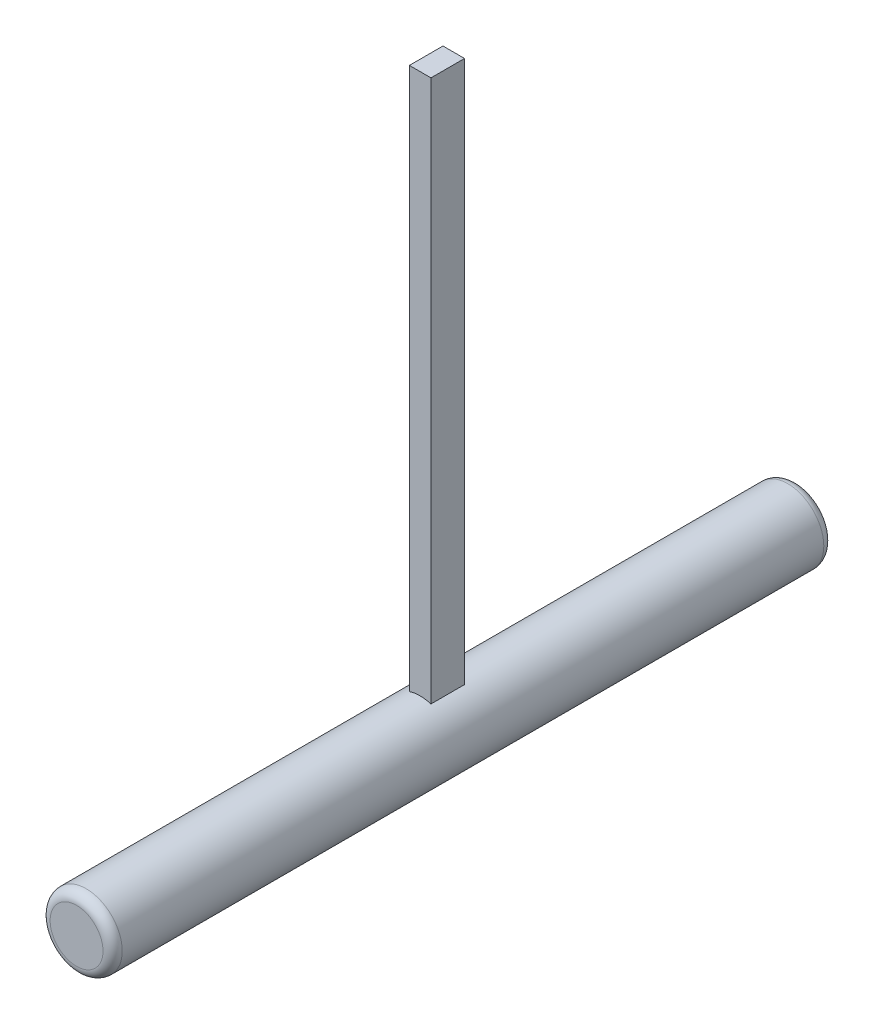
ISO-10303-21;
HEADER;
FILE_DESCRIPTION(('STEP AP214'),'2;1');
FILE_NAME('part.step','',(''),(''),'','','');
FILE_SCHEMA(('AUTOMOTIVE_DESIGN { 1 0 10303 214 1 1 1 1 }'));
ENDSEC;
DATA;
#1=APPLICATION_CONTEXT('core data for automotive mechanical design processes');
#2=APPLICATION_PROTOCOL_DEFINITION('international standard','automotive_design',2000,#1);
#3=PRODUCT_CONTEXT('',#1,'mechanical');
#4=PRODUCT('Part','Part','',(#3));
#5=PRODUCT_RELATED_PRODUCT_CATEGORY('part','',(#4));
#6=PRODUCT_DEFINITION_FORMATION('','',#4);
#7=PRODUCT_DEFINITION_CONTEXT('part definition',#1,'design');
#8=PRODUCT_DEFINITION('design','',#6,#7);
#9=PRODUCT_DEFINITION_SHAPE('','',#8);
#10=(LENGTH_UNIT() NAMED_UNIT(*) SI_UNIT(.MILLI.,.METRE.));
#11=(NAMED_UNIT(*) PLANE_ANGLE_UNIT() SI_UNIT($,.RADIAN.));
#12=(NAMED_UNIT(*) SI_UNIT($,.STERADIAN.) SOLID_ANGLE_UNIT());
#13=UNCERTAINTY_MEASURE_WITH_UNIT(LENGTH_MEASURE(1.E-05),#10,'distance_accuracy_value','');
#14=(GEOMETRIC_REPRESENTATION_CONTEXT(3) GLOBAL_UNCERTAINTY_ASSIGNED_CONTEXT((#13)) GLOBAL_UNIT_ASSIGNED_CONTEXT((#10,
#11,#12)) REPRESENTATION_CONTEXT('',''));
#15=CARTESIAN_POINT('',(0.,0.,0.));
#16=DIRECTION('',(0.,0.,1.));
#17=DIRECTION('',(1.,0.,0.));
#18=AXIS2_PLACEMENT_3D('',#15,#16,#17);
#19=CARTESIAN_POINT('',(0.,0.,150.));
#20=DIRECTION('',(0.,0.,-1.));
#21=DIRECTION('',(-1.,0.,0.));
#22=AXIS2_PLACEMENT_3D('',#19,#20,#21);
#23=CYLINDRICAL_SURFACE('',#22,7.5);
#24=DIRECTION('',(0.,0.,-1.));
#25=VECTOR('',#24,1.);
#26=CARTESIAN_POINT('',(-2.24499999999998,7.1561145183682,150.));
#27=LINE('',#26,#25);
#28=CARTESIAN_POINT('',(-2.24499999999999,7.15611451836819,71.505));
#29=VERTEX_POINT('',#28);
#30=CARTESIAN_POINT('',(-2.24499999999998,7.1561145183682,78.495));
#31=VERTEX_POINT('',#30);
#32=EDGE_CURVE('E123',#29,#31,#27,.F.);
#33=ORIENTED_EDGE('',*,*,#32,.F.);
#34=CARTESIAN_POINT('',(0.,0.,71.505));
#35=DIRECTION('',(0.,0.,-1.));
#36=DIRECTION('',(-1.,0.,0.));
#37=AXIS2_PLACEMENT_3D('',#34,#35,#36);
#38=CIRCLE('',#37,7.5);
#39=CARTESIAN_POINT('',(2.24500000000001,7.15611451836819,71.505));
#40=VERTEX_POINT('',#39);
#41=EDGE_CURVE('E115',#40,#29,#38,.F.);
#42=ORIENTED_EDGE('',*,*,#41,.F.);
#43=DIRECTION('',(0.,0.,-1.));
#44=VECTOR('',#43,1.);
#45=CARTESIAN_POINT('',(2.24500000000001,7.15611451836819,150.));
#46=LINE('',#45,#44);
#47=CARTESIAN_POINT('',(2.24500000000001,7.15611451836819,78.495));
#48=VERTEX_POINT('',#47);
#49=EDGE_CURVE('E62',#48,#40,#46,.T.);
#50=ORIENTED_EDGE('',*,*,#49,.F.);
#51=CARTESIAN_POINT('',(0.,0.,78.495));
#52=DIRECTION('',(0.,0.,1.));
#53=DIRECTION('',(1.,0.,0.));
#54=AXIS2_PLACEMENT_3D('',#51,#52,#53);
#55=CIRCLE('',#54,7.5);
#56=EDGE_CURVE('E55',#31,#48,#55,.F.);
#57=ORIENTED_EDGE('',*,*,#56,.F.);
#58=EDGE_LOOP('',(#33,#42,#50,#57));
#59=FACE_BOUND('',#58,.T.);
#60=CARTESIAN_POINT('',(0.,0.,2.));
#61=DIRECTION('',(0.,0.,1.));
#62=DIRECTION('',(1.,0.,0.));
#63=AXIS2_PLACEMENT_3D('',#60,#61,#62);
#64=CIRCLE('',#63,7.5);
#65=CARTESIAN_POINT('',(7.5,0.,2.));
#66=VERTEX_POINT('',#65);
#67=EDGE_CURVE('E128',#66,#66,#64,.T.);
#68=ORIENTED_EDGE('',*,*,#67,.T.);
#69=EDGE_LOOP('',(#68));
#70=FACE_BOUND('',#69,.T.);
#71=CARTESIAN_POINT('',(0.,0.,148.));
#72=DIRECTION('',(0.,0.,1.));
#73=DIRECTION('',(1.,0.,0.));
#74=AXIS2_PLACEMENT_3D('',#71,#72,#73);
#75=CIRCLE('',#74,7.5);
#76=CARTESIAN_POINT('',(7.5,0.,148.));
#77=VERTEX_POINT('',#76);
#78=EDGE_CURVE('E124',#77,#77,#75,.F.);
#79=ORIENTED_EDGE('',*,*,#78,.T.);
#80=EDGE_LOOP('',(#79));
#81=FACE_BOUND('',#80,.T.);
#82=ADVANCED_FACE('F39',(#59,#70,#81),#23,.T.);
#83=CARTESIAN_POINT('',(0.,0.,150.));
#84=DIRECTION('',(0.,0.,1.));
#85=DIRECTION('',(1.,0.,0.));
#86=AXIS2_PLACEMENT_3D('',#83,#84,#85);
#87=PLANE('',#86);
#88=CARTESIAN_POINT('',(0.,0.,150.));
#89=DIRECTION('',(0.,0.,1.));
#90=DIRECTION('',(1.,0.,0.));
#91=AXIS2_PLACEMENT_3D('',#88,#89,#90);
#92=CIRCLE('',#91,5.5);
#93=CARTESIAN_POINT('',(5.5,0.,150.));
#94=VERTEX_POINT('',#93);
#95=EDGE_CURVE('E11',#94,#94,#92,.T.);
#96=ORIENTED_EDGE('',*,*,#95,.T.);
#97=EDGE_LOOP('',(#96));
#98=FACE_BOUND('',#97,.T.);
#99=ADVANCED_FACE('F144',(#98),#87,.T.);
#100=CARTESIAN_POINT('',(0.,0.,0.));
#101=DIRECTION('',(0.,0.,1.));
#102=DIRECTION('',(1.,0.,0.));
#103=AXIS2_PLACEMENT_3D('',#100,#101,#102);
#104=PLANE('',#103);
#105=CARTESIAN_POINT('',(0.,0.,0.));
#106=DIRECTION('',(0.,0.,1.));
#107=DIRECTION('',(1.,0.,0.));
#108=AXIS2_PLACEMENT_3D('',#105,#106,#107);
#109=CIRCLE('',#108,5.5);
#110=CARTESIAN_POINT('',(5.5,0.,0.));
#111=VERTEX_POINT('',#110);
#112=EDGE_CURVE('E48',#111,#111,#109,.F.);
#113=ORIENTED_EDGE('',*,*,#112,.T.);
#114=EDGE_LOOP('',(#113));
#115=FACE_BOUND('',#114,.T.);
#116=ADVANCED_FACE('F135',(#115),#104,.F.);
#117=CARTESIAN_POINT('',(0.,0.,2.));
#118=DIRECTION('',(0.,0.,1.));
#119=DIRECTION('',(1.,0.,0.));
#120=AXIS2_PLACEMENT_3D('',#117,#118,#119);
#121=TOROIDAL_SURFACE('',#120,5.5,2.);
#122=ORIENTED_EDGE('',*,*,#112,.F.);
#123=EDGE_LOOP('',(#122));
#124=FACE_BOUND('',#123,.T.);
#125=ORIENTED_EDGE('',*,*,#67,.F.);
#126=EDGE_LOOP('',(#125));
#127=FACE_BOUND('',#126,.T.);
#128=ADVANCED_FACE('F137',(#124,#127),#121,.T.);
#129=CARTESIAN_POINT('',(0.,0.,148.));
#130=DIRECTION('',(0.,0.,1.));
#131=DIRECTION('',(1.,0.,0.));
#132=AXIS2_PLACEMENT_3D('',#129,#130,#131);
#133=TOROIDAL_SURFACE('',#132,5.5,2.);
#134=ORIENTED_EDGE('',*,*,#78,.F.);
#135=EDGE_LOOP('',(#134));
#136=FACE_BOUND('',#135,.T.);
#137=ORIENTED_EDGE('',*,*,#95,.F.);
#138=EDGE_LOOP('',(#137));
#139=FACE_BOUND('',#138,.T.);
#140=ADVANCED_FACE('F41',(#136,#139),#133,.T.);
#141=CARTESIAN_POINT('',(0.,120.,0.));
#142=DIRECTION('',(0.,1.,0.));
#143=DIRECTION('',(0.,0.,1.));
#144=AXIS2_PLACEMENT_3D('',#141,#142,#143);
#145=PLANE('',#144);
#146=DIRECTION('',(0.,0.,-1.));
#147=VECTOR('',#146,1.);
#148=CARTESIAN_POINT('',(2.24500000000001,120.,71.505));
#149=LINE('',#148,#147);
#150=CARTESIAN_POINT('',(2.24500000000001,120.,78.495));
#151=VERTEX_POINT('',#150);
#152=CARTESIAN_POINT('',(2.24500000000001,120.,71.505));
#153=VERTEX_POINT('',#152);
#154=EDGE_CURVE('E83',#151,#153,#149,.T.);
#155=ORIENTED_EDGE('',*,*,#154,.T.);
#156=DIRECTION('',(-1.,0.,0.));
#157=VECTOR('',#156,1.);
#158=CARTESIAN_POINT('',(-2.24499999999999,120.,71.505));
#159=LINE('',#158,#157);
#160=CARTESIAN_POINT('',(-2.24499999999999,120.,71.505));
#161=VERTEX_POINT('',#160);
#162=EDGE_CURVE('E93',#153,#161,#159,.T.);
#163=ORIENTED_EDGE('',*,*,#162,.T.);
#164=DIRECTION('',(0.,0.,1.));
#165=VECTOR('',#164,1.);
#166=CARTESIAN_POINT('',(-2.24499999999999,120.,71.505));
#167=LINE('',#166,#165);
#168=CARTESIAN_POINT('',(-2.24499999999999,120.,78.495));
#169=VERTEX_POINT('',#168);
#170=EDGE_CURVE('E99',#161,#169,#167,.T.);
#171=ORIENTED_EDGE('',*,*,#170,.T.);
#172=DIRECTION('',(1.,0.,0.));
#173=VECTOR('',#172,1.);
#174=CARTESIAN_POINT('',(-2.24499999999999,120.,78.495));
#175=LINE('',#174,#173);
#176=EDGE_CURVE('E90',#169,#151,#175,.T.);
#177=ORIENTED_EDGE('',*,*,#176,.T.);
#178=EDGE_LOOP('',(#155,#163,#171,#177));
#179=FACE_BOUND('',#178,.T.);
#180=ADVANCED_FACE('F101',(#179),#145,.T.);
#181=CARTESIAN_POINT('',(-2.24499999999999,-7.50100000000001,71.505));
#182=DIRECTION('',(0.,0.,-1.));
#183=DIRECTION('',(-1.,0.,0.));
#184=AXIS2_PLACEMENT_3D('',#181,#182,#183);
#185=PLANE('',#184);
#186=DIRECTION('',(0.,1.,0.));
#187=VECTOR('',#186,1.);
#188=CARTESIAN_POINT('',(2.24500000000001,-7.50100000000001,71.505));
#189=LINE('',#188,#187);
#190=EDGE_CURVE('E79',#40,#153,#189,.T.);
#191=ORIENTED_EDGE('',*,*,#190,.F.);
#192=ORIENTED_EDGE('',*,*,#41,.T.);
#193=DIRECTION('',(0.,1.,0.));
#194=VECTOR('',#193,1.);
#195=CARTESIAN_POINT('',(-2.24499999999999,-7.50100000000001,71.505));
#196=LINE('',#195,#194);
#197=EDGE_CURVE('E89',#29,#161,#196,.T.);
#198=ORIENTED_EDGE('',*,*,#197,.T.);
#199=ORIENTED_EDGE('',*,*,#162,.F.);
#200=EDGE_LOOP('',(#191,#192,#198,#199));
#201=FACE_BOUND('',#200,.T.);
#202=ADVANCED_FACE('F94',(#201),#185,.T.);
#203=CARTESIAN_POINT('',(-2.24499999999999,-7.50100000000001,71.505));
#204=DIRECTION('',(-1.,0.,0.));
#205=DIRECTION('',(0.,0.,1.));
#206=AXIS2_PLACEMENT_3D('',#203,#204,#205);
#207=PLANE('',#206);
#208=ORIENTED_EDGE('',*,*,#197,.F.);
#209=ORIENTED_EDGE('',*,*,#32,.T.);
#210=DIRECTION('',(0.,1.,0.));
#211=VECTOR('',#210,1.);
#212=CARTESIAN_POINT('',(-2.24499999999999,-7.50100000000001,78.495));
#213=LINE('',#212,#211);
#214=EDGE_CURVE('E116',#31,#169,#213,.T.);
#215=ORIENTED_EDGE('',*,*,#214,.T.);
#216=ORIENTED_EDGE('',*,*,#170,.F.);
#217=EDGE_LOOP('',(#208,#209,#215,#216));
#218=FACE_BOUND('',#217,.T.);
#219=ADVANCED_FACE('F165',(#218),#207,.T.);
#220=CARTESIAN_POINT('',(-2.24499999999999,-7.50100000000001,78.495));
#221=DIRECTION('',(0.,0.,1.));
#222=DIRECTION('',(1.,0.,0.));
#223=AXIS2_PLACEMENT_3D('',#220,#221,#222);
#224=PLANE('',#223);
#225=ORIENTED_EDGE('',*,*,#214,.F.);
#226=ORIENTED_EDGE('',*,*,#56,.T.);
#227=DIRECTION('',(0.,1.,0.));
#228=VECTOR('',#227,1.);
#229=CARTESIAN_POINT('',(2.24500000000001,-7.50100000000001,78.495));
#230=LINE('',#229,#228);
#231=EDGE_CURVE('E112',#48,#151,#230,.T.);
#232=ORIENTED_EDGE('',*,*,#231,.T.);
#233=ORIENTED_EDGE('',*,*,#176,.F.);
#234=EDGE_LOOP('',(#225,#226,#232,#233));
#235=FACE_BOUND('',#234,.T.);
#236=ADVANCED_FACE('F162',(#235),#224,.T.);
#237=CARTESIAN_POINT('',(2.24500000000001,-7.50100000000001,71.505));
#238=DIRECTION('',(1.,0.,0.));
#239=DIRECTION('',(0.,0.,-1.));
#240=AXIS2_PLACEMENT_3D('',#237,#238,#239);
#241=PLANE('',#240);
#242=ORIENTED_EDGE('',*,*,#231,.F.);
#243=ORIENTED_EDGE('',*,*,#49,.T.);
#244=ORIENTED_EDGE('',*,*,#190,.T.);
#245=ORIENTED_EDGE('',*,*,#154,.F.);
#246=EDGE_LOOP('',(#242,#243,#244,#245));
#247=FACE_BOUND('',#246,.T.);
#248=ADVANCED_FACE('F81',(#247),#241,.T.);
#249=CLOSED_SHELL('',(#82,#99,#116,#128,#140,#180,#202,#219,#236,#248));
#250=MANIFOLD_SOLID_BREP('B2',#249);
#251=ADVANCED_BREP_SHAPE_REPRESENTATION('',(#18,#250),#14);
#252=SHAPE_DEFINITION_REPRESENTATION(#9,#251);
ENDSEC;
END-ISO-10303-21;
